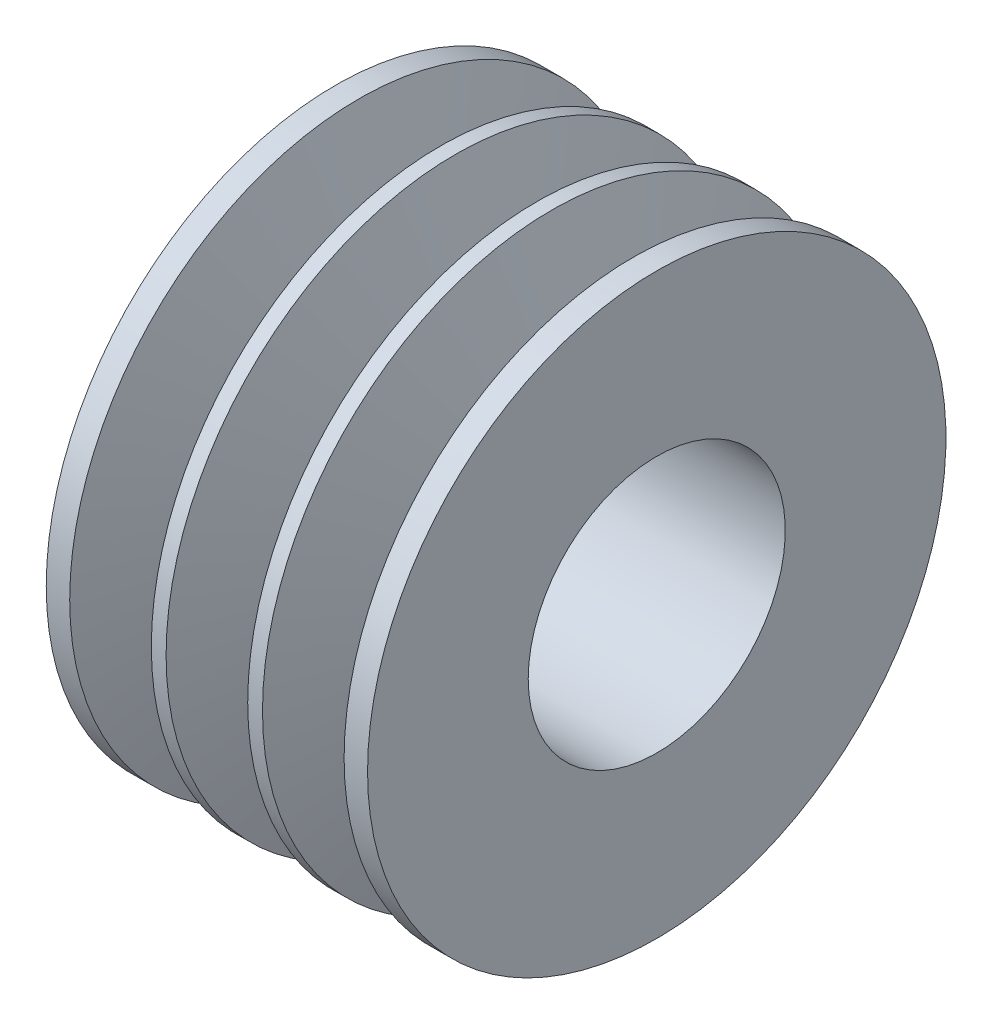
ISO-10303-21;
HEADER;
FILE_DESCRIPTION(('STEP AP214'),'2;1');
FILE_NAME('part.step','',(''),(''),'','','');
FILE_SCHEMA(('AUTOMOTIVE_DESIGN { 1 0 10303 214 1 1 1 1 }'));
ENDSEC;
DATA;
#1=APPLICATION_CONTEXT('core data for automotive mechanical design processes');
#2=APPLICATION_PROTOCOL_DEFINITION('international standard','automotive_design',2000,#1);
#3=PRODUCT_CONTEXT('',#1,'mechanical');
#4=PRODUCT('Part','Part','',(#3));
#5=PRODUCT_RELATED_PRODUCT_CATEGORY('part','',(#4));
#6=PRODUCT_DEFINITION_FORMATION('','',#4);
#7=PRODUCT_DEFINITION_CONTEXT('part definition',#1,'design');
#8=PRODUCT_DEFINITION('design','',#6,#7);
#9=PRODUCT_DEFINITION_SHAPE('','',#8);
#10=(LENGTH_UNIT() NAMED_UNIT(*) SI_UNIT(.MILLI.,.METRE.));
#11=(NAMED_UNIT(*) PLANE_ANGLE_UNIT() SI_UNIT($,.RADIAN.));
#12=(NAMED_UNIT(*) SI_UNIT($,.STERADIAN.) SOLID_ANGLE_UNIT());
#13=UNCERTAINTY_MEASURE_WITH_UNIT(LENGTH_MEASURE(1.E-05),#10,'distance_accuracy_value','');
#14=(GEOMETRIC_REPRESENTATION_CONTEXT(3) GLOBAL_UNCERTAINTY_ASSIGNED_CONTEXT((#13)) GLOBAL_UNIT_ASSIGNED_CONTEXT((#10,
#11,#12)) REPRESENTATION_CONTEXT('',''));
#15=CARTESIAN_POINT('',(0.,0.,0.));
#16=DIRECTION('',(0.,0.,1.));
#17=DIRECTION('',(1.,0.,0.));
#18=AXIS2_PLACEMENT_3D('',#15,#16,#17);
#19=CARTESIAN_POINT('',(45.0996374714627,45.9746499464162,0.));
#20=DIRECTION('',(1.,0.,0.));
#21=DIRECTION('',(0.,0.,-1.));
#22=AXIS2_PLACEMENT_3D('',#19,#20,#21);
#23=PLANE('',#22);
#24=CARTESIAN_POINT('',(45.0996374714627,25.9746499464162,0.));
#25=DIRECTION('',(-1.,0.,0.));
#26=DIRECTION('',(0.,0.,1.));
#27=AXIS2_PLACEMENT_3D('',#24,#25,#26);
#28=CIRCLE('',#27,20.);
#29=CARTESIAN_POINT('',(45.0996374714627,25.9746499464162,20.));
#30=VERTEX_POINT('',#29);
#31=EDGE_CURVE('E82',#30,#30,#28,.T.);
#32=ORIENTED_EDGE('',*,*,#31,.F.);
#33=EDGE_LOOP('',(#32));
#34=FACE_BOUND('',#33,.T.);
#35=CARTESIAN_POINT('',(45.0996374714627,25.9746499464162,0.));
#36=DIRECTION('',(-1.,0.,0.));
#37=DIRECTION('',(0.,0.,1.));
#38=AXIS2_PLACEMENT_3D('',#35,#36,#37);
#39=CIRCLE('',#38,45.);
#40=CARTESIAN_POINT('',(45.0996374714627,25.9746499464162,45.));
#41=VERTEX_POINT('',#40);
#42=EDGE_CURVE('E10',#41,#41,#39,.T.);
#43=ORIENTED_EDGE('',*,*,#42,.T.);
#44=EDGE_LOOP('',(#43));
#45=FACE_BOUND('',#44,.T.);
#46=ADVANCED_FACE('F30',(#34,#45),#23,.F.);
#47=CARTESIAN_POINT('',(24.8217538719555,25.9746499464162,0.));
#48=DIRECTION('',(-1.,0.,0.));
#49=DIRECTION('',(0.,0.,1.));
#50=AXIS2_PLACEMENT_3D('',#47,#48,#49);
#51=CYLINDRICAL_SURFACE('',#50,45.);
#52=ORIENTED_EDGE('',*,*,#42,.F.);
#53=EDGE_LOOP('',(#52));
#54=FACE_BOUND('',#53,.T.);
#55=CARTESIAN_POINT('',(48.7496374714628,25.9746499464162,0.));
#56=DIRECTION('',(-1.,0.,0.));
#57=DIRECTION('',(0.,0.,1.));
#58=AXIS2_PLACEMENT_3D('',#55,#56,#57);
#59=CIRCLE('',#58,45.);
#60=CARTESIAN_POINT('',(48.7496374714628,25.9746499464162,45.));
#61=VERTEX_POINT('',#60);
#62=EDGE_CURVE('E36',#61,#61,#59,.T.);
#63=ORIENTED_EDGE('',*,*,#62,.T.);
#64=EDGE_LOOP('',(#63));
#65=FACE_BOUND('',#64,.T.);
#66=ADVANCED_FACE('F89',(#54,#65),#51,.T.);
#67=CARTESIAN_POINT('',(52.9687208755923,25.9746499464162,0.));
#68=DIRECTION('',(-1.,0.,0.));
#69=DIRECTION('',(0.,0.,1.));
#70=AXIS2_PLACEMENT_3D('',#67,#68,#69);
#71=CONICAL_SURFACE('',#70,31.2,1.27409035395586);
#72=ORIENTED_EDGE('',*,*,#62,.F.);
#73=EDGE_LOOP('',(#72));
#74=FACE_BOUND('',#73,.T.);
#75=CARTESIAN_POINT('',(52.9687208755923,25.9746499464162,0.));
#76=DIRECTION('',(-1.,0.,0.));
#77=DIRECTION('',(0.,0.,1.));
#78=AXIS2_PLACEMENT_3D('',#75,#76,#77);
#79=CIRCLE('',#78,31.2);
#80=CARTESIAN_POINT('',(52.9687208755923,25.9746499464162,31.2));
#81=VERTEX_POINT('',#80);
#82=EDGE_CURVE('E40',#81,#81,#79,.T.);
#83=ORIENTED_EDGE('',*,*,#82,.T.);
#84=EDGE_LOOP('',(#83));
#85=FACE_BOUND('',#84,.T.);
#86=ADVANCED_FACE('F93',(#74,#85),#71,.T.);
#87=CARTESIAN_POINT('',(24.8217538719555,25.9746499464162,0.));
#88=DIRECTION('',(-1.,0.,0.));
#89=DIRECTION('',(0.,0.,1.));
#90=AXIS2_PLACEMENT_3D('',#87,#88,#89);
#91=CYLINDRICAL_SURFACE('',#90,31.2);
#92=ORIENTED_EDGE('',*,*,#82,.F.);
#93=EDGE_LOOP('',(#92));
#94=FACE_BOUND('',#93,.T.);
#95=CARTESIAN_POINT('',(57.2305540673332,25.9746499464162,0.));
#96=DIRECTION('',(-1.,0.,0.));
#97=DIRECTION('',(0.,0.,1.));
#98=AXIS2_PLACEMENT_3D('',#95,#96,#97);
#99=CIRCLE('',#98,31.2);
#100=CARTESIAN_POINT('',(57.2305540673332,25.9746499464162,31.2));
#101=VERTEX_POINT('',#100);
#102=EDGE_CURVE('E44',#101,#101,#99,.T.);
#103=ORIENTED_EDGE('',*,*,#102,.T.);
#104=EDGE_LOOP('',(#103));
#105=FACE_BOUND('',#104,.T.);
#106=ADVANCED_FACE('F98',(#94,#105),#91,.T.);
#107=CARTESIAN_POINT('',(61.4496374714628,25.9746499464162,0.));
#108=DIRECTION('',(1.,0.,0.));
#109=DIRECTION('',(0.,0.,-1.));
#110=AXIS2_PLACEMENT_3D('',#107,#108,#109);
#111=CONICAL_SURFACE('',#110,45.,1.27409035395586);
#112=ORIENTED_EDGE('',*,*,#102,.F.);
#113=EDGE_LOOP('',(#112));
#114=FACE_BOUND('',#113,.T.);
#115=CARTESIAN_POINT('',(61.4496374714628,25.9746499464162,0.));
#116=DIRECTION('',(-1.,0.,0.));
#117=DIRECTION('',(0.,0.,1.));
#118=AXIS2_PLACEMENT_3D('',#115,#116,#117);
#119=CIRCLE('',#118,45.);
#120=CARTESIAN_POINT('',(61.4496374714628,25.9746499464162,45.));
#121=VERTEX_POINT('',#120);
#122=EDGE_CURVE('E49',#121,#121,#119,.T.);
#123=ORIENTED_EDGE('',*,*,#122,.T.);
#124=EDGE_LOOP('',(#123));
#125=FACE_BOUND('',#124,.T.);
#126=ADVANCED_FACE('F104',(#114,#125),#111,.T.);
#127=CARTESIAN_POINT('',(24.8217538719555,25.9746499464162,0.));
#128=DIRECTION('',(-1.,0.,0.));
#129=DIRECTION('',(0.,0.,1.));
#130=AXIS2_PLACEMENT_3D('',#127,#128,#129);
#131=CYLINDRICAL_SURFACE('',#130,45.);
#132=ORIENTED_EDGE('',*,*,#122,.F.);
#133=EDGE_LOOP('',(#132));
#134=FACE_BOUND('',#133,.T.);
#135=CARTESIAN_POINT('',(63.7496374714628,25.9746499464162,0.));
#136=DIRECTION('',(-1.,0.,0.));
#137=DIRECTION('',(0.,0.,1.));
#138=AXIS2_PLACEMENT_3D('',#135,#136,#137);
#139=CIRCLE('',#138,45.);
#140=CARTESIAN_POINT('',(63.7496374714628,25.9746499464162,45.));
#141=VERTEX_POINT('',#140);
#142=EDGE_CURVE('E52',#141,#141,#139,.T.);
#143=ORIENTED_EDGE('',*,*,#142,.T.);
#144=EDGE_LOOP('',(#143));
#145=FACE_BOUND('',#144,.T.);
#146=ADVANCED_FACE('F108',(#134,#145),#131,.T.);
#147=CARTESIAN_POINT('',(67.9687208755923,25.9746499464162,0.));
#148=DIRECTION('',(-1.,0.,0.));
#149=DIRECTION('',(0.,0.,1.));
#150=AXIS2_PLACEMENT_3D('',#147,#148,#149);
#151=CONICAL_SURFACE('',#150,31.2,1.27409035395586);
#152=ORIENTED_EDGE('',*,*,#142,.F.);
#153=EDGE_LOOP('',(#152));
#154=FACE_BOUND('',#153,.T.);
#155=CARTESIAN_POINT('',(67.9687208755923,25.9746499464162,0.));
#156=DIRECTION('',(-1.,0.,0.));
#157=DIRECTION('',(0.,0.,1.));
#158=AXIS2_PLACEMENT_3D('',#155,#156,#157);
#159=CIRCLE('',#158,31.2);
#160=CARTESIAN_POINT('',(67.9687208755923,25.9746499464162,31.2));
#161=VERTEX_POINT('',#160);
#162=EDGE_CURVE('E55',#161,#161,#159,.T.);
#163=ORIENTED_EDGE('',*,*,#162,.T.);
#164=EDGE_LOOP('',(#163));
#165=FACE_BOUND('',#164,.T.);
#166=ADVANCED_FACE('F112',(#154,#165),#151,.T.);
#167=CARTESIAN_POINT('',(24.8217538719555,25.9746499464162,0.));
#168=DIRECTION('',(-1.,0.,0.));
#169=DIRECTION('',(0.,0.,1.));
#170=AXIS2_PLACEMENT_3D('',#167,#168,#169);
#171=CYLINDRICAL_SURFACE('',#170,31.2);
#172=ORIENTED_EDGE('',*,*,#162,.F.);
#173=EDGE_LOOP('',(#172));
#174=FACE_BOUND('',#173,.T.);
#175=CARTESIAN_POINT('',(72.2305540673332,25.9746499464162,0.));
#176=DIRECTION('',(-1.,0.,0.));
#177=DIRECTION('',(0.,0.,1.));
#178=AXIS2_PLACEMENT_3D('',#175,#176,#177);
#179=CIRCLE('',#178,31.2);
#180=CARTESIAN_POINT('',(72.2305540673332,25.9746499464162,31.2));
#181=VERTEX_POINT('',#180);
#182=EDGE_CURVE('E58',#181,#181,#179,.T.);
#183=ORIENTED_EDGE('',*,*,#182,.T.);
#184=EDGE_LOOP('',(#183));
#185=FACE_BOUND('',#184,.T.);
#186=ADVANCED_FACE('F116',(#174,#185),#171,.T.);
#187=CARTESIAN_POINT('',(76.4496374714628,25.9746499464162,0.));
#188=DIRECTION('',(1.,0.,0.));
#189=DIRECTION('',(0.,0.,-1.));
#190=AXIS2_PLACEMENT_3D('',#187,#188,#189);
#191=CONICAL_SURFACE('',#190,45.,1.27409035395586);
#192=ORIENTED_EDGE('',*,*,#182,.F.);
#193=EDGE_LOOP('',(#192));
#194=FACE_BOUND('',#193,.T.);
#195=CARTESIAN_POINT('',(76.4496374714628,25.9746499464162,0.));
#196=DIRECTION('',(-1.,0.,0.));
#197=DIRECTION('',(0.,0.,1.));
#198=AXIS2_PLACEMENT_3D('',#195,#196,#197);
#199=CIRCLE('',#198,45.);
#200=CARTESIAN_POINT('',(76.4496374714628,25.9746499464162,45.));
#201=VERTEX_POINT('',#200);
#202=EDGE_CURVE('E61',#201,#201,#199,.T.);
#203=ORIENTED_EDGE('',*,*,#202,.T.);
#204=EDGE_LOOP('',(#203));
#205=FACE_BOUND('',#204,.T.);
#206=ADVANCED_FACE('F120',(#194,#205),#191,.T.);
#207=CARTESIAN_POINT('',(24.8217538719555,25.9746499464162,0.));
#208=DIRECTION('',(-1.,0.,0.));
#209=DIRECTION('',(0.,0.,1.));
#210=AXIS2_PLACEMENT_3D('',#207,#208,#209);
#211=CYLINDRICAL_SURFACE('',#210,45.);
#212=ORIENTED_EDGE('',*,*,#202,.F.);
#213=EDGE_LOOP('',(#212));
#214=FACE_BOUND('',#213,.T.);
#215=CARTESIAN_POINT('',(78.7496374714628,25.9746499464162,0.));
#216=DIRECTION('',(-1.,0.,0.));
#217=DIRECTION('',(0.,0.,1.));
#218=AXIS2_PLACEMENT_3D('',#215,#216,#217);
#219=CIRCLE('',#218,45.);
#220=CARTESIAN_POINT('',(78.7496374714628,25.9746499464162,45.));
#221=VERTEX_POINT('',#220);
#222=EDGE_CURVE('E64',#221,#221,#219,.T.);
#223=ORIENTED_EDGE('',*,*,#222,.T.);
#224=EDGE_LOOP('',(#223));
#225=FACE_BOUND('',#224,.T.);
#226=ADVANCED_FACE('F124',(#214,#225),#211,.T.);
#227=CARTESIAN_POINT('',(82.9687208755923,25.9746499464162,0.));
#228=DIRECTION('',(-1.,0.,0.));
#229=DIRECTION('',(0.,0.,1.));
#230=AXIS2_PLACEMENT_3D('',#227,#228,#229);
#231=CONICAL_SURFACE('',#230,31.2,1.27409035395586);
#232=ORIENTED_EDGE('',*,*,#222,.F.);
#233=EDGE_LOOP('',(#232));
#234=FACE_BOUND('',#233,.T.);
#235=CARTESIAN_POINT('',(82.9687208755923,25.9746499464162,0.));
#236=DIRECTION('',(-1.,0.,0.));
#237=DIRECTION('',(0.,0.,1.));
#238=AXIS2_PLACEMENT_3D('',#235,#236,#237);
#239=CIRCLE('',#238,31.2);
#240=CARTESIAN_POINT('',(82.9687208755923,25.9746499464162,31.2));
#241=VERTEX_POINT('',#240);
#242=EDGE_CURVE('E67',#241,#241,#239,.T.);
#243=ORIENTED_EDGE('',*,*,#242,.T.);
#244=EDGE_LOOP('',(#243));
#245=FACE_BOUND('',#244,.T.);
#246=ADVANCED_FACE('F128',(#234,#245),#231,.T.);
#247=CARTESIAN_POINT('',(24.8217538719555,25.9746499464162,0.));
#248=DIRECTION('',(-1.,0.,0.));
#249=DIRECTION('',(0.,0.,1.));
#250=AXIS2_PLACEMENT_3D('',#247,#248,#249);
#251=CYLINDRICAL_SURFACE('',#250,31.2);
#252=ORIENTED_EDGE('',*,*,#242,.F.);
#253=EDGE_LOOP('',(#252));
#254=FACE_BOUND('',#253,.T.);
#255=CARTESIAN_POINT('',(87.2305540673332,25.9746499464162,0.));
#256=DIRECTION('',(-1.,0.,0.));
#257=DIRECTION('',(0.,0.,1.));
#258=AXIS2_PLACEMENT_3D('',#255,#256,#257);
#259=CIRCLE('',#258,31.2);
#260=CARTESIAN_POINT('',(87.2305540673332,25.9746499464162,31.2));
#261=VERTEX_POINT('',#260);
#262=EDGE_CURVE('E70',#261,#261,#259,.T.);
#263=ORIENTED_EDGE('',*,*,#262,.T.);
#264=EDGE_LOOP('',(#263));
#265=FACE_BOUND('',#264,.T.);
#266=ADVANCED_FACE('F132',(#254,#265),#251,.T.);
#267=CARTESIAN_POINT('',(91.4496374714628,25.9746499464162,0.));
#268=DIRECTION('',(1.,0.,0.));
#269=DIRECTION('',(0.,0.,-1.));
#270=AXIS2_PLACEMENT_3D('',#267,#268,#269);
#271=CONICAL_SURFACE('',#270,45.,1.27409035395586);
#272=ORIENTED_EDGE('',*,*,#262,.F.);
#273=EDGE_LOOP('',(#272));
#274=FACE_BOUND('',#273,.T.);
#275=CARTESIAN_POINT('',(91.4496374714628,25.9746499464162,0.));
#276=DIRECTION('',(-1.,0.,0.));
#277=DIRECTION('',(0.,0.,1.));
#278=AXIS2_PLACEMENT_3D('',#275,#276,#277);
#279=CIRCLE('',#278,45.);
#280=CARTESIAN_POINT('',(91.4496374714628,25.9746499464162,45.));
#281=VERTEX_POINT('',#280);
#282=EDGE_CURVE('E73',#281,#281,#279,.T.);
#283=ORIENTED_EDGE('',*,*,#282,.T.);
#284=EDGE_LOOP('',(#283));
#285=FACE_BOUND('',#284,.T.);
#286=ADVANCED_FACE('F136',(#274,#285),#271,.T.);
#287=CARTESIAN_POINT('',(24.8217538719555,25.9746499464162,0.));
#288=DIRECTION('',(-1.,0.,0.));
#289=DIRECTION('',(0.,0.,1.));
#290=AXIS2_PLACEMENT_3D('',#287,#288,#289);
#291=CYLINDRICAL_SURFACE('',#290,45.);
#292=ORIENTED_EDGE('',*,*,#282,.F.);
#293=EDGE_LOOP('',(#292));
#294=FACE_BOUND('',#293,.T.);
#295=CARTESIAN_POINT('',(95.0996374714628,25.9746499464162,0.));
#296=DIRECTION('',(-1.,0.,0.));
#297=DIRECTION('',(0.,0.,1.));
#298=AXIS2_PLACEMENT_3D('',#295,#296,#297);
#299=CIRCLE('',#298,45.);
#300=CARTESIAN_POINT('',(95.0996374714628,25.9746499464162,45.));
#301=VERTEX_POINT('',#300);
#302=EDGE_CURVE('E76',#301,#301,#299,.T.);
#303=ORIENTED_EDGE('',*,*,#302,.T.);
#304=EDGE_LOOP('',(#303));
#305=FACE_BOUND('',#304,.T.);
#306=ADVANCED_FACE('F140',(#294,#305),#291,.T.);
#307=CARTESIAN_POINT('',(95.0996374714628,45.9746499464162,0.));
#308=DIRECTION('',(-1.,0.,0.));
#309=DIRECTION('',(0.,0.,1.));
#310=AXIS2_PLACEMENT_3D('',#307,#308,#309);
#311=PLANE('',#310);
#312=ORIENTED_EDGE('',*,*,#302,.F.);
#313=EDGE_LOOP('',(#312));
#314=FACE_BOUND('',#313,.T.);
#315=CARTESIAN_POINT('',(95.0996374714628,25.9746499464162,0.));
#316=DIRECTION('',(-1.,0.,0.));
#317=DIRECTION('',(0.,0.,1.));
#318=AXIS2_PLACEMENT_3D('',#315,#316,#317);
#319=CIRCLE('',#318,20.);
#320=CARTESIAN_POINT('',(95.0996374714628,25.9746499464162,20.));
#321=VERTEX_POINT('',#320);
#322=EDGE_CURVE('E79',#321,#321,#319,.T.);
#323=ORIENTED_EDGE('',*,*,#322,.T.);
#324=EDGE_LOOP('',(#323));
#325=FACE_BOUND('',#324,.T.);
#326=ADVANCED_FACE('F144',(#314,#325),#311,.F.);
#327=CARTESIAN_POINT('',(24.8217538719555,25.9746499464162,0.));
#328=DIRECTION('',(-1.,0.,0.));
#329=DIRECTION('',(0.,0.,1.));
#330=AXIS2_PLACEMENT_3D('',#327,#328,#329);
#331=CYLINDRICAL_SURFACE('',#330,20.);
#332=ORIENTED_EDGE('',*,*,#322,.F.);
#333=EDGE_LOOP('',(#332));
#334=FACE_BOUND('',#333,.T.);
#335=ORIENTED_EDGE('',*,*,#31,.T.);
#336=EDGE_LOOP('',(#335));
#337=FACE_BOUND('',#336,.T.);
#338=ADVANCED_FACE('F86',(#334,#337),#331,.F.);
#339=CLOSED_SHELL('',(#46,#66,#86,#106,#126,#146,#166,#186,#206,#226,#246,#266,#286,#306,#326,#338));
#340=MANIFOLD_SOLID_BREP('B2',#339);
#341=ADVANCED_BREP_SHAPE_REPRESENTATION('',(#18,#340),#14);
#342=SHAPE_DEFINITION_REPRESENTATION(#9,#341);
ENDSEC;
END-ISO-10303-21;
